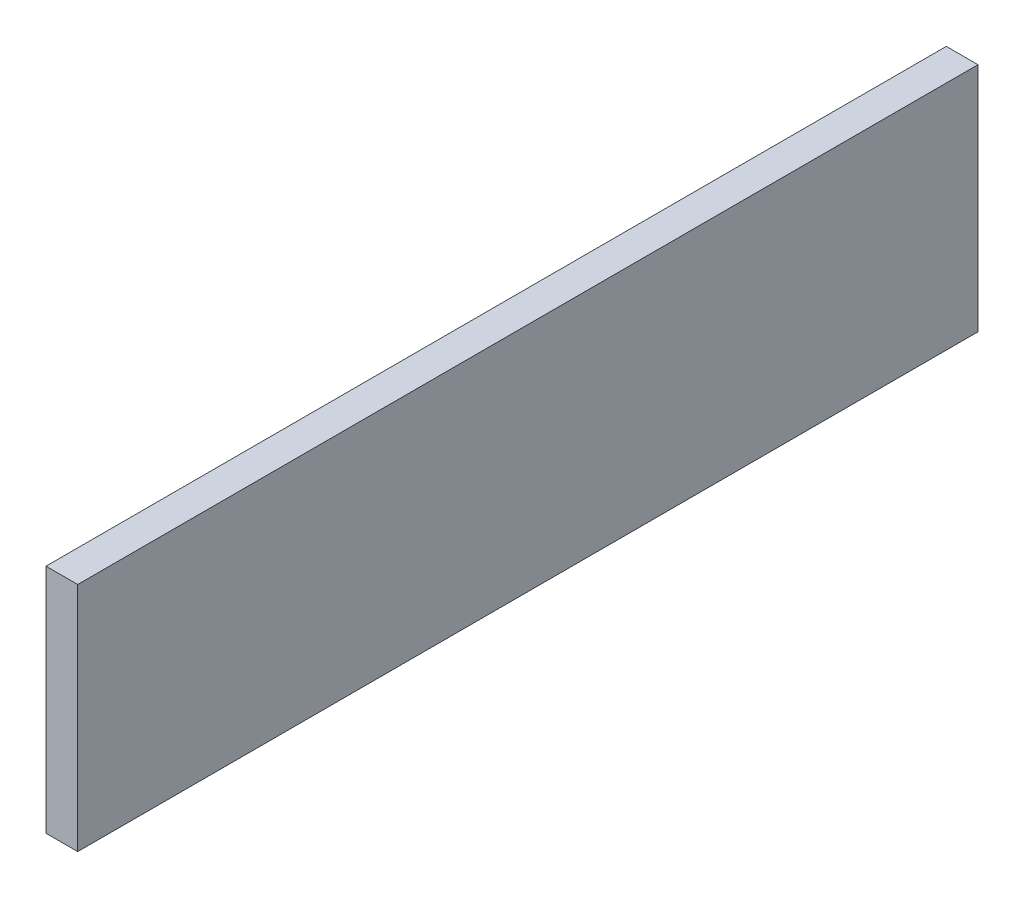
ISO-10303-21;
HEADER;
FILE_DESCRIPTION(('STEP AP214'),'2;1');
FILE_NAME('part.step','',(''),(''),'','','');
FILE_SCHEMA(('AUTOMOTIVE_DESIGN { 1 0 10303 214 1 1 1 1 }'));
ENDSEC;
DATA;
#1=APPLICATION_CONTEXT('core data for automotive mechanical design processes');
#2=APPLICATION_PROTOCOL_DEFINITION('international standard','automotive_design',2000,#1);
#3=PRODUCT_CONTEXT('',#1,'mechanical');
#4=PRODUCT('Part','Part','',(#3));
#5=PRODUCT_RELATED_PRODUCT_CATEGORY('part','',(#4));
#6=PRODUCT_DEFINITION_FORMATION('','',#4);
#7=PRODUCT_DEFINITION_CONTEXT('part definition',#1,'design');
#8=PRODUCT_DEFINITION('design','',#6,#7);
#9=PRODUCT_DEFINITION_SHAPE('','',#8);
#10=(LENGTH_UNIT() NAMED_UNIT(*) SI_UNIT(.MILLI.,.METRE.));
#11=(NAMED_UNIT(*) PLANE_ANGLE_UNIT() SI_UNIT($,.RADIAN.));
#12=(NAMED_UNIT(*) SI_UNIT($,.STERADIAN.) SOLID_ANGLE_UNIT());
#13=UNCERTAINTY_MEASURE_WITH_UNIT(LENGTH_MEASURE(1.E-05),#10,'distance_accuracy_value','');
#14=(GEOMETRIC_REPRESENTATION_CONTEXT(3) GLOBAL_UNCERTAINTY_ASSIGNED_CONTEXT((#13)) GLOBAL_UNIT_ASSIGNED_CONTEXT((#10,
#11,#12)) REPRESENTATION_CONTEXT('',''));
#15=CARTESIAN_POINT('',(0.,0.,0.));
#16=DIRECTION('',(0.,0.,1.));
#17=DIRECTION('',(1.,0.,0.));
#18=AXIS2_PLACEMENT_3D('',#15,#16,#17);
#19=CARTESIAN_POINT('',(1.5875,11.585,90.17));
#20=DIRECTION('',(-1.,0.,0.));
#21=DIRECTION('',(0.,-1.,0.));
#22=AXIS2_PLACEMENT_3D('',#19,#20,#21);
#23=PLANE('',#22);
#24=DIRECTION('',(0.,1.,0.));
#25=VECTOR('',#24,1.);
#26=CARTESIAN_POINT('',(1.5875,11.585,0.));
#27=LINE('',#26,#25);
#28=CARTESIAN_POINT('',(1.5875,-11.585,0.));
#29=VERTEX_POINT('',#28);
#30=CARTESIAN_POINT('',(1.5875,11.585,0.));
#31=VERTEX_POINT('',#30);
#32=EDGE_CURVE('E107',#29,#31,#27,.T.);
#33=ORIENTED_EDGE('',*,*,#32,.T.);
#34=DIRECTION('',(0.,0.,-1.));
#35=VECTOR('',#34,1.);
#36=CARTESIAN_POINT('',(1.5875,11.585,90.17));
#37=LINE('',#36,#35);
#38=CARTESIAN_POINT('',(1.5875,11.585,90.17));
#39=VERTEX_POINT('',#38);
#40=EDGE_CURVE('E11',#39,#31,#37,.T.);
#41=ORIENTED_EDGE('',*,*,#40,.F.);
#42=DIRECTION('',(0.,1.,0.));
#43=VECTOR('',#42,1.);
#44=CARTESIAN_POINT('',(1.5875,11.585,90.17));
#45=LINE('',#44,#43);
#46=CARTESIAN_POINT('',(1.5875,-11.585,90.17));
#47=VERTEX_POINT('',#46);
#48=EDGE_CURVE('E91',#47,#39,#45,.T.);
#49=ORIENTED_EDGE('',*,*,#48,.F.);
#50=DIRECTION('',(0.,0.,-1.));
#51=VECTOR('',#50,1.);
#52=CARTESIAN_POINT('',(1.5875,-11.585,90.17));
#53=LINE('',#52,#51);
#54=EDGE_CURVE('E103',#47,#29,#53,.T.);
#55=ORIENTED_EDGE('',*,*,#54,.T.);
#56=EDGE_LOOP('',(#33,#41,#49,#55));
#57=FACE_BOUND('',#56,.T.);
#58=ADVANCED_FACE('F39',(#57),#23,.F.);
#59=CARTESIAN_POINT('',(-1.5875,11.585,90.17));
#60=DIRECTION('',(0.,-1.,0.));
#61=DIRECTION('',(0.,0.,-1.));
#62=AXIS2_PLACEMENT_3D('',#59,#60,#61);
#63=PLANE('',#62);
#64=DIRECTION('',(-1.,0.,0.));
#65=VECTOR('',#64,1.);
#66=CARTESIAN_POINT('',(-1.5875,11.585,0.));
#67=LINE('',#66,#65);
#68=CARTESIAN_POINT('',(-1.5875,11.585,0.));
#69=VERTEX_POINT('',#68);
#70=EDGE_CURVE('E96',#31,#69,#67,.T.);
#71=ORIENTED_EDGE('',*,*,#70,.T.);
#72=DIRECTION('',(0.,0.,-1.));
#73=VECTOR('',#72,1.);
#74=CARTESIAN_POINT('',(-1.5875,11.585,90.17));
#75=LINE('',#74,#73);
#76=CARTESIAN_POINT('',(-1.5875,11.585,90.17));
#77=VERTEX_POINT('',#76);
#78=EDGE_CURVE('E48',#77,#69,#75,.T.);
#79=ORIENTED_EDGE('',*,*,#78,.F.);
#80=DIRECTION('',(-1.,0.,0.));
#81=VECTOR('',#80,1.);
#82=CARTESIAN_POINT('',(-1.5875,11.585,90.17));
#83=LINE('',#82,#81);
#84=EDGE_CURVE('E86',#39,#77,#83,.T.);
#85=ORIENTED_EDGE('',*,*,#84,.F.);
#86=ORIENTED_EDGE('',*,*,#40,.T.);
#87=EDGE_LOOP('',(#71,#79,#85,#86));
#88=FACE_BOUND('',#87,.T.);
#89=ADVANCED_FACE('F95',(#88),#63,.F.);
#90=CARTESIAN_POINT('',(-1.5875,11.585,90.17));
#91=DIRECTION('',(1.,0.,0.));
#92=DIRECTION('',(0.,1.,0.));
#93=AXIS2_PLACEMENT_3D('',#90,#91,#92);
#94=PLANE('',#93);
#95=DIRECTION('',(0.,-1.,0.));
#96=VECTOR('',#95,1.);
#97=CARTESIAN_POINT('',(-1.5875,11.585,0.));
#98=LINE('',#97,#96);
#99=CARTESIAN_POINT('',(-1.5875,-11.585,0.));
#100=VERTEX_POINT('',#99);
#101=EDGE_CURVE('E73',#69,#100,#98,.T.);
#102=ORIENTED_EDGE('',*,*,#101,.T.);
#103=DIRECTION('',(0.,0.,-1.));
#104=VECTOR('',#103,1.);
#105=CARTESIAN_POINT('',(-1.5875,-11.585,90.17));
#106=LINE('',#105,#104);
#107=CARTESIAN_POINT('',(-1.5875,-11.585,90.17));
#108=VERTEX_POINT('',#107);
#109=EDGE_CURVE('E98',#108,#100,#106,.T.);
#110=ORIENTED_EDGE('',*,*,#109,.F.);
#111=DIRECTION('',(0.,-1.,0.));
#112=VECTOR('',#111,1.);
#113=CARTESIAN_POINT('',(-1.5875,11.585,90.17));
#114=LINE('',#113,#112);
#115=EDGE_CURVE('E89',#77,#108,#114,.T.);
#116=ORIENTED_EDGE('',*,*,#115,.F.);
#117=ORIENTED_EDGE('',*,*,#78,.T.);
#118=EDGE_LOOP('',(#102,#110,#116,#117));
#119=FACE_BOUND('',#118,.T.);
#120=ADVANCED_FACE('F99',(#119),#94,.F.);
#121=CARTESIAN_POINT('',(-1.5875,-11.585,90.17));
#122=DIRECTION('',(0.,1.,0.));
#123=DIRECTION('',(0.,0.,1.));
#124=AXIS2_PLACEMENT_3D('',#121,#122,#123);
#125=PLANE('',#124);
#126=DIRECTION('',(1.,0.,0.));
#127=VECTOR('',#126,1.);
#128=CARTESIAN_POINT('',(-1.5875,-11.585,0.));
#129=LINE('',#128,#127);
#130=EDGE_CURVE('E79',#100,#29,#129,.T.);
#131=ORIENTED_EDGE('',*,*,#130,.T.);
#132=ORIENTED_EDGE('',*,*,#54,.F.);
#133=DIRECTION('',(1.,0.,0.));
#134=VECTOR('',#133,1.);
#135=CARTESIAN_POINT('',(-1.5875,-11.585,90.17));
#136=LINE('',#135,#134);
#137=EDGE_CURVE('E56',#108,#47,#136,.T.);
#138=ORIENTED_EDGE('',*,*,#137,.F.);
#139=ORIENTED_EDGE('',*,*,#109,.T.);
#140=EDGE_LOOP('',(#131,#132,#138,#139));
#141=FACE_BOUND('',#140,.T.);
#142=ADVANCED_FACE('F120',(#141),#125,.F.);
#143=CARTESIAN_POINT('',(0.,0.,90.17));
#144=DIRECTION('',(0.,0.,1.));
#145=DIRECTION('',(1.,0.,0.));
#146=AXIS2_PLACEMENT_3D('',#143,#144,#145);
#147=PLANE('',#146);
#148=ORIENTED_EDGE('',*,*,#48,.T.);
#149=ORIENTED_EDGE('',*,*,#84,.T.);
#150=ORIENTED_EDGE('',*,*,#115,.T.);
#151=ORIENTED_EDGE('',*,*,#137,.T.);
#152=EDGE_LOOP('',(#148,#149,#150,#151));
#153=FACE_BOUND('',#152,.T.);
#154=ADVANCED_FACE('F87',(#153),#147,.T.);
#155=CARTESIAN_POINT('',(0.,0.,0.));
#156=DIRECTION('',(0.,0.,1.));
#157=DIRECTION('',(1.,0.,0.));
#158=AXIS2_PLACEMENT_3D('',#155,#156,#157);
#159=PLANE('',#158);
#160=ORIENTED_EDGE('',*,*,#32,.F.);
#161=ORIENTED_EDGE('',*,*,#130,.F.);
#162=ORIENTED_EDGE('',*,*,#101,.F.);
#163=ORIENTED_EDGE('',*,*,#70,.F.);
#164=EDGE_LOOP('',(#160,#161,#162,#163));
#165=FACE_BOUND('',#164,.T.);
#166=ADVANCED_FACE('F123',(#165),#159,.F.);
#167=CLOSED_SHELL('',(#58,#89,#120,#142,#154,#166));
#168=MANIFOLD_SOLID_BREP('B2',#167);
#169=ADVANCED_BREP_SHAPE_REPRESENTATION('',(#18,#168),#14);
#170=SHAPE_DEFINITION_REPRESENTATION(#9,#169);
ENDSEC;
END-ISO-10303-21;
